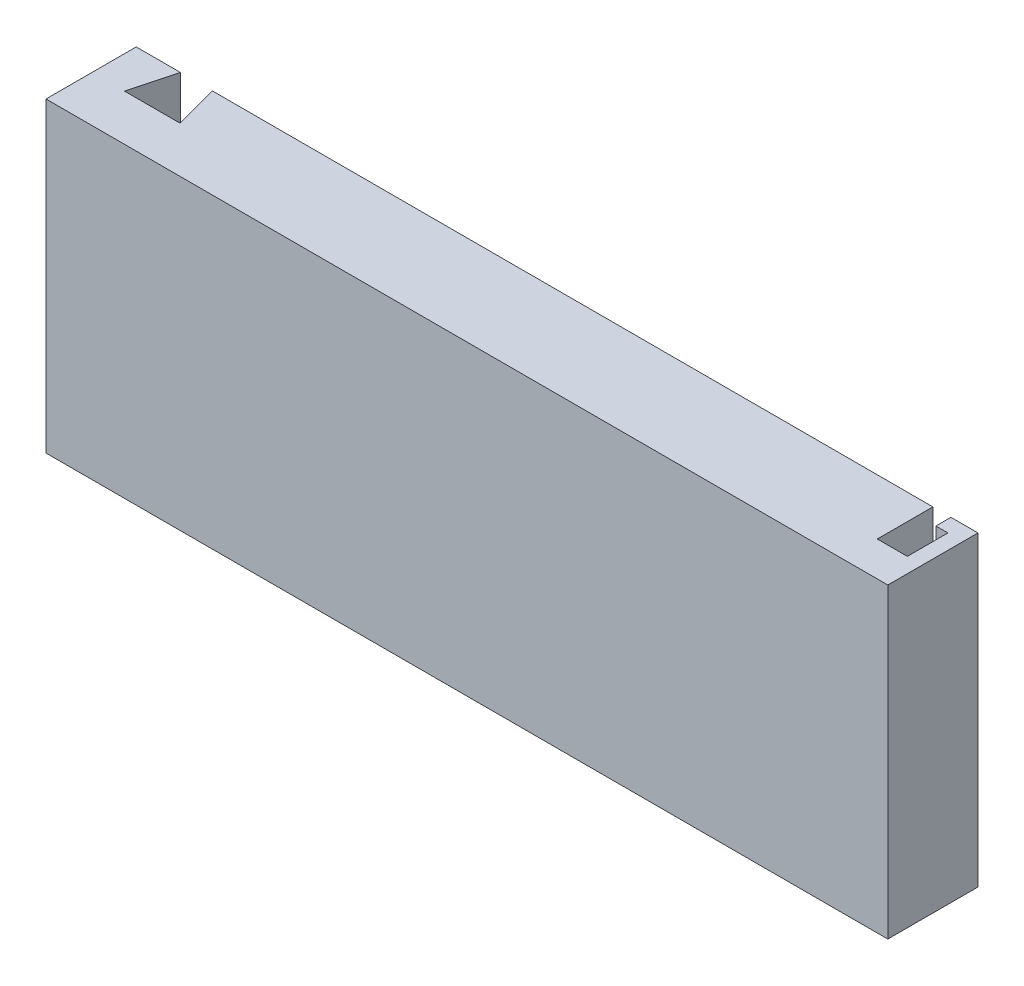
ISO-10303-21;
HEADER;
FILE_DESCRIPTION(('STEP AP214'),'2;1');
FILE_NAME('part.step','',(''),(''),'','','');
FILE_SCHEMA(('AUTOMOTIVE_DESIGN { 1 0 10303 214 1 1 1 1 }'));
ENDSEC;
DATA;
#1=APPLICATION_CONTEXT('core data for automotive mechanical design processes');
#2=APPLICATION_PROTOCOL_DEFINITION('international standard','automotive_design',2000,#1);
#3=PRODUCT_CONTEXT('',#1,'mechanical');
#4=PRODUCT('Part','Part','',(#3));
#5=PRODUCT_RELATED_PRODUCT_CATEGORY('part','',(#4));
#6=PRODUCT_DEFINITION_FORMATION('','',#4);
#7=PRODUCT_DEFINITION_CONTEXT('part definition',#1,'design');
#8=PRODUCT_DEFINITION('design','',#6,#7);
#9=PRODUCT_DEFINITION_SHAPE('','',#8);
#10=(LENGTH_UNIT() NAMED_UNIT(*) SI_UNIT(.MILLI.,.METRE.));
#11=(NAMED_UNIT(*) PLANE_ANGLE_UNIT() SI_UNIT($,.RADIAN.));
#12=(NAMED_UNIT(*) SI_UNIT($,.STERADIAN.) SOLID_ANGLE_UNIT());
#13=UNCERTAINTY_MEASURE_WITH_UNIT(LENGTH_MEASURE(1.E-05),#10,'distance_accuracy_value','');
#14=(GEOMETRIC_REPRESENTATION_CONTEXT(3) GLOBAL_UNCERTAINTY_ASSIGNED_CONTEXT((#13)) GLOBAL_UNIT_ASSIGNED_CONTEXT((#10,
#11,#12)) REPRESENTATION_CONTEXT('',''));
#15=CARTESIAN_POINT('',(0.,0.,0.));
#16=DIRECTION('',(0.,0.,1.));
#17=DIRECTION('',(1.,0.,0.));
#18=AXIS2_PLACEMENT_3D('',#15,#16,#17);
#19=CARTESIAN_POINT('',(0.,0.,0.));
#20=DIRECTION('',(0.,0.,1.));
#21=DIRECTION('',(1.,0.,0.));
#22=AXIS2_PLACEMENT_3D('',#19,#20,#21);
#23=PLANE('',#22);
#24=DIRECTION('',(0.,1.,0.));
#25=VECTOR('',#24,1.);
#26=CARTESIAN_POINT('',(74.5633802816902,-22.387323943662,0.));
#27=LINE('',#26,#25);
#28=CARTESIAN_POINT('',(74.5633802816902,-22.387323943662,0.));
#29=VERTEX_POINT('',#28);
#30=CARTESIAN_POINT('',(74.5633802816902,28.612676056338,0.));
#31=VERTEX_POINT('',#30);
#32=EDGE_CURVE('E236',#29,#31,#27,.T.);
#33=ORIENTED_EDGE('',*,*,#32,.T.);
#34=DIRECTION('',(-1.,0.,0.));
#35=VECTOR('',#34,1.);
#36=CARTESIAN_POINT('',(-60.9366197183099,28.612676056338,0.));
#37=LINE('',#36,#35);
#38=CARTESIAN_POINT('',(79.0633802816902,28.612676056338,0.));
#39=VERTEX_POINT('',#38);
#40=EDGE_CURVE('E249',#39,#31,#37,.T.);
#41=ORIENTED_EDGE('',*,*,#40,.F.);
#42=DIRECTION('',(0.,1.,0.));
#43=VECTOR('',#42,1.);
#44=CARTESIAN_POINT('',(79.0633802816902,28.612676056338,0.));
#45=LINE('',#44,#43);
#46=CARTESIAN_POINT('',(79.0633802816902,-22.387323943662,0.));
#47=VERTEX_POINT('',#46);
#48=EDGE_CURVE('E266',#47,#39,#45,.T.);
#49=ORIENTED_EDGE('',*,*,#48,.F.);
#50=DIRECTION('',(1.,0.,0.));
#51=VECTOR('',#50,1.);
#52=CARTESIAN_POINT('',(-60.9366197183099,-22.387323943662,0.));
#53=LINE('',#52,#51);
#54=EDGE_CURVE('E261',#29,#47,#53,.T.);
#55=ORIENTED_EDGE('',*,*,#54,.F.);
#56=EDGE_LOOP('',(#33,#41,#49,#55));
#57=FACE_BOUND('',#56,.T.);
#58=ADVANCED_FACE('F43',(#57),#23,.F.);
#59=CARTESIAN_POINT('',(-60.9366197183099,28.612676056338,15.));
#60=DIRECTION('',(1.,0.,0.));
#61=DIRECTION('',(0.,0.,-1.));
#62=AXIS2_PLACEMENT_3D('',#59,#60,#61);
#63=PLANE('',#62);
#64=DIRECTION('',(0.,-1.,0.));
#65=VECTOR('',#64,1.);
#66=CARTESIAN_POINT('',(-60.9366197183099,28.612676056338,0.));
#67=LINE('',#66,#65);
#68=CARTESIAN_POINT('',(-60.9366197183099,28.612676056338,0.));
#69=VERTEX_POINT('',#68);
#70=CARTESIAN_POINT('',(-60.9366197183099,-22.387323943662,0.));
#71=VERTEX_POINT('',#70);
#72=EDGE_CURVE('E229',#69,#71,#67,.T.);
#73=ORIENTED_EDGE('',*,*,#72,.T.);
#74=DIRECTION('',(0.,0.,-1.));
#75=VECTOR('',#74,1.);
#76=CARTESIAN_POINT('',(-60.9366197183099,-22.387323943662,15.));
#77=LINE('',#76,#75);
#78=CARTESIAN_POINT('',(-60.9366197183099,-22.387323943662,15.));
#79=VERTEX_POINT('',#78);
#80=EDGE_CURVE('E11',#79,#71,#77,.T.);
#81=ORIENTED_EDGE('',*,*,#80,.F.);
#82=DIRECTION('',(0.,-1.,0.));
#83=VECTOR('',#82,1.);
#84=CARTESIAN_POINT('',(-60.9366197183099,28.612676056338,15.));
#85=LINE('',#84,#83);
#86=CARTESIAN_POINT('',(-60.9366197183099,28.612676056338,15.));
#87=VERTEX_POINT('',#86);
#88=EDGE_CURVE('E244',#87,#79,#85,.T.);
#89=ORIENTED_EDGE('',*,*,#88,.F.);
#90=DIRECTION('',(0.,0.,-1.));
#91=VECTOR('',#90,1.);
#92=CARTESIAN_POINT('',(-60.9366197183099,28.612676056338,15.));
#93=LINE('',#92,#91);
#94=EDGE_CURVE('E258',#87,#69,#93,.T.);
#95=ORIENTED_EDGE('',*,*,#94,.T.);
#96=EDGE_LOOP('',(#73,#81,#89,#95));
#97=FACE_BOUND('',#96,.T.);
#98=ADVANCED_FACE('F45',(#97),#63,.F.);
#99=CARTESIAN_POINT('',(-60.9366197183099,-22.387323943662,15.));
#100=DIRECTION('',(0.,1.,0.));
#101=DIRECTION('',(0.,0.,1.));
#102=AXIS2_PLACEMENT_3D('',#99,#100,#101);
#103=PLANE('',#102);
#104=CARTESIAN_POINT('',(71.5633802816902,-22.387323943662,0.));
#105=VERTEX_POINT('',#104);
#106=EDGE_CURVE('E262',#71,#105,#53,.T.);
#107=ORIENTED_EDGE('',*,*,#106,.T.);
#108=DIRECTION('',(0.,0.,1.));
#109=VECTOR('',#108,1.);
#110=CARTESIAN_POINT('',(71.5633802816902,-22.387323943662,0.));
#111=LINE('',#110,#109);
#112=CARTESIAN_POINT('',(71.5633802816902,-22.387323943662,9.25));
#113=VERTEX_POINT('',#112);
#114=EDGE_CURVE('E201',#105,#113,#111,.T.);
#115=ORIENTED_EDGE('',*,*,#114,.T.);
#116=DIRECTION('',(1.,0.,0.));
#117=VECTOR('',#116,1.);
#118=CARTESIAN_POINT('',(0.,-22.387323943662,9.25000000000002));
#119=LINE('',#118,#117);
#120=CARTESIAN_POINT('',(76.5633802816902,-22.387323943662,9.25));
#121=VERTEX_POINT('',#120);
#122=EDGE_CURVE('E205',#113,#121,#119,.T.);
#123=ORIENTED_EDGE('',*,*,#122,.T.);
#124=DIRECTION('',(0.,0.,1.));
#125=VECTOR('',#124,1.);
#126=CARTESIAN_POINT('',(76.5633802816902,-22.387323943662,0.));
#127=LINE('',#126,#125);
#128=CARTESIAN_POINT('',(76.5633802816902,-22.387323943662,2.5));
#129=VERTEX_POINT('',#128);
#130=EDGE_CURVE('E191',#129,#121,#127,.T.);
#131=ORIENTED_EDGE('',*,*,#130,.F.);
#132=DIRECTION('',(1.,0.,0.));
#133=VECTOR('',#132,1.);
#134=CARTESIAN_POINT('',(0.,-22.387323943662,2.5));
#135=LINE('',#134,#133);
#136=CARTESIAN_POINT('',(74.5633802816902,-22.387323943662,2.5));
#137=VERTEX_POINT('',#136);
#138=EDGE_CURVE('E194',#137,#129,#135,.T.);
#139=ORIENTED_EDGE('',*,*,#138,.F.);
#140=DIRECTION('',(0.,0.,1.));
#141=VECTOR('',#140,1.);
#142=CARTESIAN_POINT('',(74.5633802816902,-22.387323943662,0.));
#143=LINE('',#142,#141);
#144=EDGE_CURVE('E198',#29,#137,#143,.T.);
#145=ORIENTED_EDGE('',*,*,#144,.F.);
#146=ORIENTED_EDGE('',*,*,#54,.T.);
#147=DIRECTION('',(0.,0.,-1.));
#148=VECTOR('',#147,1.);
#149=CARTESIAN_POINT('',(79.0633802816902,-22.387323943662,15.));
#150=LINE('',#149,#148);
#151=CARTESIAN_POINT('',(79.0633802816902,-22.387323943662,15.));
#152=VERTEX_POINT('',#151);
#153=EDGE_CURVE('E52',#152,#47,#150,.T.);
#154=ORIENTED_EDGE('',*,*,#153,.F.);
#155=DIRECTION('',(1.,0.,0.));
#156=VECTOR('',#155,1.);
#157=CARTESIAN_POINT('',(-60.9366197183099,-22.387323943662,15.));
#158=LINE('',#157,#156);
#159=EDGE_CURVE('E248',#79,#152,#158,.T.);
#160=ORIENTED_EDGE('',*,*,#159,.F.);
#161=ORIENTED_EDGE('',*,*,#80,.T.);
#162=EDGE_LOOP('',(#107,#115,#123,#131,#139,#145,#146,#154,#160,#161));
#163=FACE_BOUND('',#162,.T.);
#164=ADVANCED_FACE('F297',(#163),#103,.F.);
#165=CARTESIAN_POINT('',(79.0633802816902,28.612676056338,15.));
#166=DIRECTION('',(-1.,0.,0.));
#167=DIRECTION('',(0.,0.,1.));
#168=AXIS2_PLACEMENT_3D('',#165,#166,#167);
#169=PLANE('',#168);
#170=ORIENTED_EDGE('',*,*,#48,.T.);
#171=DIRECTION('',(0.,0.,-1.));
#172=VECTOR('',#171,1.);
#173=CARTESIAN_POINT('',(79.0633802816902,28.612676056338,15.));
#174=LINE('',#173,#172);
#175=CARTESIAN_POINT('',(79.0633802816902,28.612676056338,15.));
#176=VERTEX_POINT('',#175);
#177=EDGE_CURVE('E276',#176,#39,#174,.T.);
#178=ORIENTED_EDGE('',*,*,#177,.F.);
#179=DIRECTION('',(0.,1.,0.));
#180=VECTOR('',#179,1.);
#181=CARTESIAN_POINT('',(79.0633802816902,28.612676056338,15.));
#182=LINE('',#181,#180);
#183=EDGE_CURVE('E252',#152,#176,#182,.T.);
#184=ORIENTED_EDGE('',*,*,#183,.F.);
#185=ORIENTED_EDGE('',*,*,#153,.T.);
#186=EDGE_LOOP('',(#170,#178,#184,#185));
#187=FACE_BOUND('',#186,.T.);
#188=ADVANCED_FACE('F285',(#187),#169,.F.);
#189=CARTESIAN_POINT('',(-60.9366197183099,28.612676056338,15.));
#190=DIRECTION('',(0.,-1.,0.));
#191=DIRECTION('',(0.,0.,-1.));
#192=AXIS2_PLACEMENT_3D('',#189,#190,#191);
#193=PLANE('',#192);
#194=CARTESIAN_POINT('',(71.5633802816902,28.612676056338,0.));
#195=VERTEX_POINT('',#194);
#196=CARTESIAN_POINT('',(-48.2866197183099,28.612676056338,0.));
#197=VERTEX_POINT('',#196);
#198=EDGE_CURVE('E170',#195,#197,#37,.T.);
#199=ORIENTED_EDGE('',*,*,#198,.T.);
#200=DIRECTION('',(0.258819045102518,0.,0.965925826289069));
#201=VECTOR('',#200,1.);
#202=CARTESIAN_POINT('',(-46.3195949755307,28.612676056338,7.34103627979693));
#203=LINE('',#202,#201);
#204=CARTESIAN_POINT('',(-46.3195949755307,28.612676056338,7.34103627979693));
#205=VERTEX_POINT('',#204);
#206=EDGE_CURVE('E159',#197,#205,#203,.T.);
#207=ORIENTED_EDGE('',*,*,#206,.T.);
#208=DIRECTION('',(-1.,0.,0.));
#209=VECTOR('',#208,1.);
#210=CARTESIAN_POINT('',(-55.553644461089,28.612676056338,7.34103627979693));
#211=LINE('',#210,#209);
#212=CARTESIAN_POINT('',(-55.553644461089,28.612676056338,7.34103627979693));
#213=VERTEX_POINT('',#212);
#214=EDGE_CURVE('E147',#205,#213,#211,.T.);
#215=ORIENTED_EDGE('',*,*,#214,.T.);
#216=DIRECTION('',(0.258819045102518,0.,-0.965925826289069));
#217=VECTOR('',#216,1.);
#218=CARTESIAN_POINT('',(-53.5866197183098,28.612676056338,0.));
#219=LINE('',#218,#217);
#220=CARTESIAN_POINT('',(-53.5866197183098,28.612676056338,0.));
#221=VERTEX_POINT('',#220);
#222=EDGE_CURVE('E158',#213,#221,#219,.T.);
#223=ORIENTED_EDGE('',*,*,#222,.T.);
#224=EDGE_CURVE('E269',#221,#69,#37,.T.);
#225=ORIENTED_EDGE('',*,*,#224,.T.);
#226=ORIENTED_EDGE('',*,*,#94,.F.);
#227=DIRECTION('',(-1.,0.,0.));
#228=VECTOR('',#227,1.);
#229=CARTESIAN_POINT('',(-60.9366197183099,28.612676056338,15.));
#230=LINE('',#229,#228);
#231=EDGE_CURVE('E255',#176,#87,#230,.T.);
#232=ORIENTED_EDGE('',*,*,#231,.F.);
#233=ORIENTED_EDGE('',*,*,#177,.T.);
#234=ORIENTED_EDGE('',*,*,#40,.T.);
#235=DIRECTION('',(0.,0.,1.));
#236=VECTOR('',#235,1.);
#237=CARTESIAN_POINT('',(74.5633802816902,28.612676056338,0.));
#238=LINE('',#237,#236);
#239=CARTESIAN_POINT('',(74.5633802816902,28.612676056338,2.5));
#240=VERTEX_POINT('',#239);
#241=EDGE_CURVE('E67',#31,#240,#238,.T.);
#242=ORIENTED_EDGE('',*,*,#241,.T.);
#243=DIRECTION('',(1.,0.,0.));
#244=VECTOR('',#243,1.);
#245=CARTESIAN_POINT('',(0.,28.612676056338,2.5));
#246=LINE('',#245,#244);
#247=CARTESIAN_POINT('',(76.5633802816902,28.612676056338,2.5));
#248=VERTEX_POINT('',#247);
#249=EDGE_CURVE('E213',#240,#248,#246,.T.);
#250=ORIENTED_EDGE('',*,*,#249,.T.);
#251=DIRECTION('',(0.,0.,1.));
#252=VECTOR('',#251,1.);
#253=CARTESIAN_POINT('',(76.5633802816902,28.612676056338,0.));
#254=LINE('',#253,#252);
#255=CARTESIAN_POINT('',(76.5633802816902,28.612676056338,9.25));
#256=VERTEX_POINT('',#255);
#257=EDGE_CURVE('E164',#248,#256,#254,.T.);
#258=ORIENTED_EDGE('',*,*,#257,.T.);
#259=DIRECTION('',(1.,0.,0.));
#260=VECTOR('',#259,1.);
#261=CARTESIAN_POINT('',(0.,28.612676056338,9.25000000000002));
#262=LINE('',#261,#260);
#263=CARTESIAN_POINT('',(71.5633802816902,28.612676056338,9.25));
#264=VERTEX_POINT('',#263);
#265=EDGE_CURVE('E195',#264,#256,#262,.T.);
#266=ORIENTED_EDGE('',*,*,#265,.F.);
#267=DIRECTION('',(0.,0.,1.));
#268=VECTOR('',#267,1.);
#269=CARTESIAN_POINT('',(71.5633802816902,28.612676056338,0.));
#270=LINE('',#269,#268);
#271=EDGE_CURVE('E219',#195,#264,#270,.T.);
#272=ORIENTED_EDGE('',*,*,#271,.F.);
#273=EDGE_LOOP('',(#199,#207,#215,#223,#225,#226,#232,#233,#234,#242,#250,#258,#266,#272));
#274=FACE_BOUND('',#273,.T.);
#275=ADVANCED_FACE('F167',(#274),#193,.F.);
#276=CARTESIAN_POINT('',(0.,0.,15.));
#277=DIRECTION('',(0.,0.,1.));
#278=DIRECTION('',(1.,0.,0.));
#279=AXIS2_PLACEMENT_3D('',#276,#277,#278);
#280=PLANE('',#279);
#281=ORIENTED_EDGE('',*,*,#88,.T.);
#282=ORIENTED_EDGE('',*,*,#159,.T.);
#283=ORIENTED_EDGE('',*,*,#183,.T.);
#284=ORIENTED_EDGE('',*,*,#231,.T.);
#285=EDGE_LOOP('',(#281,#282,#283,#284));
#286=FACE_BOUND('',#285,.T.);
#287=ADVANCED_FACE('F295',(#286),#280,.T.);
#288=ORIENTED_EDGE('',*,*,#224,.F.);
#289=DIRECTION('',(0.,-1.,0.));
#290=VECTOR('',#289,1.);
#291=CARTESIAN_POINT('',(-53.5866197183098,215.80408878673,0.));
#292=LINE('',#291,#290);
#293=CARTESIAN_POINT('',(-53.5866197183098,2.61267605633802,0.));
#294=VERTEX_POINT('',#293);
#295=EDGE_CURVE('E183',#221,#294,#292,.T.);
#296=ORIENTED_EDGE('',*,*,#295,.T.);
#297=DIRECTION('',(-1.,0.,0.));
#298=VECTOR('',#297,1.);
#299=CARTESIAN_POINT('',(-60.9366197183099,2.61267605633802,0.));
#300=LINE('',#299,#298);
#301=CARTESIAN_POINT('',(-48.2866197183099,2.61267605633802,0.));
#302=VERTEX_POINT('',#301);
#303=EDGE_CURVE('E172',#302,#294,#300,.T.);
#304=ORIENTED_EDGE('',*,*,#303,.F.);
#305=DIRECTION('',(0.,-1.,0.));
#306=VECTOR('',#305,1.);
#307=CARTESIAN_POINT('',(-48.2866197183099,215.80408878673,0.));
#308=LINE('',#307,#306);
#309=EDGE_CURVE('E59',#197,#302,#308,.T.);
#310=ORIENTED_EDGE('',*,*,#309,.F.);
#311=ORIENTED_EDGE('',*,*,#198,.F.);
#312=DIRECTION('',(0.,1.,0.));
#313=VECTOR('',#312,1.);
#314=CARTESIAN_POINT('',(71.5633802816902,-22.387323943662,0.));
#315=LINE('',#314,#313);
#316=EDGE_CURVE('E233',#105,#195,#315,.T.);
#317=ORIENTED_EDGE('',*,*,#316,.F.);
#318=ORIENTED_EDGE('',*,*,#106,.F.);
#319=ORIENTED_EDGE('',*,*,#72,.F.);
#320=EDGE_LOOP('',(#288,#296,#304,#310,#311,#317,#318,#319));
#321=FACE_BOUND('',#320,.T.);
#322=ADVANCED_FACE('F304',(#321),#23,.F.);
#323=CARTESIAN_POINT('',(76.5633802816902,-22.387323943662,0.));
#324=DIRECTION('',(-1.,0.,0.));
#325=DIRECTION('',(0.,0.,1.));
#326=AXIS2_PLACEMENT_3D('',#323,#324,#325);
#327=PLANE('',#326);
#328=ORIENTED_EDGE('',*,*,#257,.F.);
#329=DIRECTION('',(0.,1.,0.));
#330=VECTOR('',#329,1.);
#331=CARTESIAN_POINT('',(76.5633802816902,-22.387323943662,2.5));
#332=LINE('',#331,#330);
#333=EDGE_CURVE('E209',#129,#248,#332,.T.);
#334=ORIENTED_EDGE('',*,*,#333,.F.);
#335=ORIENTED_EDGE('',*,*,#130,.T.);
#336=DIRECTION('',(0.,1.,0.));
#337=VECTOR('',#336,1.);
#338=CARTESIAN_POINT('',(76.5633802816902,-22.387323943662,9.25));
#339=LINE('',#338,#337);
#340=EDGE_CURVE('E226',#121,#256,#339,.T.);
#341=ORIENTED_EDGE('',*,*,#340,.T.);
#342=EDGE_LOOP('',(#328,#334,#335,#341));
#343=FACE_BOUND('',#342,.T.);
#344=ADVANCED_FACE('F318',(#343),#327,.T.);
#345=CARTESIAN_POINT('',(0.,-22.387323943662,9.25000000000002));
#346=DIRECTION('',(0.,0.,1.));
#347=DIRECTION('',(1.,0.,0.));
#348=AXIS2_PLACEMENT_3D('',#345,#346,#347);
#349=PLANE('',#348);
#350=ORIENTED_EDGE('',*,*,#265,.T.);
#351=ORIENTED_EDGE('',*,*,#340,.F.);
#352=ORIENTED_EDGE('',*,*,#122,.F.);
#353=DIRECTION('',(0.,1.,0.));
#354=VECTOR('',#353,1.);
#355=CARTESIAN_POINT('',(71.5633802816902,-22.387323943662,9.25));
#356=LINE('',#355,#354);
#357=EDGE_CURVE('E230',#113,#264,#356,.T.);
#358=ORIENTED_EDGE('',*,*,#357,.T.);
#359=EDGE_LOOP('',(#350,#351,#352,#358));
#360=FACE_BOUND('',#359,.T.);
#361=ADVANCED_FACE('F311',(#360),#349,.F.);
#362=CARTESIAN_POINT('',(71.5633802816902,-22.387323943662,0.));
#363=DIRECTION('',(-1.,0.,0.));
#364=DIRECTION('',(0.,0.,1.));
#365=AXIS2_PLACEMENT_3D('',#362,#363,#364);
#366=PLANE('',#365);
#367=ORIENTED_EDGE('',*,*,#271,.T.);
#368=ORIENTED_EDGE('',*,*,#357,.F.);
#369=ORIENTED_EDGE('',*,*,#114,.F.);
#370=ORIENTED_EDGE('',*,*,#316,.T.);
#371=EDGE_LOOP('',(#367,#368,#369,#370));
#372=FACE_BOUND('',#371,.T.);
#373=ADVANCED_FACE('F306',(#372),#366,.F.);
#374=CARTESIAN_POINT('',(74.5633802816902,-22.387323943662,0.));
#375=DIRECTION('',(-1.,0.,0.));
#376=DIRECTION('',(0.,0.,1.));
#377=AXIS2_PLACEMENT_3D('',#374,#375,#376);
#378=PLANE('',#377);
#379=ORIENTED_EDGE('',*,*,#241,.F.);
#380=ORIENTED_EDGE('',*,*,#32,.F.);
#381=ORIENTED_EDGE('',*,*,#144,.T.);
#382=DIRECTION('',(0.,1.,0.));
#383=VECTOR('',#382,1.);
#384=CARTESIAN_POINT('',(74.5633802816902,-22.387323943662,2.5));
#385=LINE('',#384,#383);
#386=EDGE_CURVE('E239',#137,#240,#385,.T.);
#387=ORIENTED_EDGE('',*,*,#386,.T.);
#388=EDGE_LOOP('',(#379,#380,#381,#387));
#389=FACE_BOUND('',#388,.T.);
#390=ADVANCED_FACE('F323',(#389),#378,.T.);
#391=CARTESIAN_POINT('',(0.,-22.387323943662,2.5));
#392=DIRECTION('',(0.,0.,1.));
#393=DIRECTION('',(1.,0.,0.));
#394=AXIS2_PLACEMENT_3D('',#391,#392,#393);
#395=PLANE('',#394);
#396=ORIENTED_EDGE('',*,*,#249,.F.);
#397=ORIENTED_EDGE('',*,*,#386,.F.);
#398=ORIENTED_EDGE('',*,*,#138,.T.);
#399=ORIENTED_EDGE('',*,*,#333,.T.);
#400=EDGE_LOOP('',(#396,#397,#398,#399));
#401=FACE_BOUND('',#400,.T.);
#402=ADVANCED_FACE('F321',(#401),#395,.T.);
#403=CARTESIAN_POINT('',(-46.3195949755307,215.80408878673,7.34103627979693));
#404=DIRECTION('',(-0.965925826289069,0.,0.258819045102518));
#405=DIRECTION('',(0.258819045102518,0.,0.965925826289069));
#406=AXIS2_PLACEMENT_3D('',#403,#404,#405);
#407=PLANE('',#406);
#408=ORIENTED_EDGE('',*,*,#206,.F.);
#409=ORIENTED_EDGE('',*,*,#309,.T.);
#410=DIRECTION('',(0.258819045102518,0.,0.965925826289069));
#411=VECTOR('',#410,1.);
#412=CARTESIAN_POINT('',(-46.3195949755307,2.61267605633803,7.34103627979693));
#413=LINE('',#412,#411);
#414=CARTESIAN_POINT('',(-46.3195949755307,2.61267605633802,7.34103627979693));
#415=VERTEX_POINT('',#414);
#416=EDGE_CURVE('E162',#302,#415,#413,.T.);
#417=ORIENTED_EDGE('',*,*,#416,.T.);
#418=DIRECTION('',(0.,-1.,0.));
#419=VECTOR('',#418,1.);
#420=CARTESIAN_POINT('',(-46.3195949755307,215.80408878673,7.34103627979693));
#421=LINE('',#420,#419);
#422=EDGE_CURVE('E151',#205,#415,#421,.T.);
#423=ORIENTED_EDGE('',*,*,#422,.F.);
#424=EDGE_LOOP('',(#408,#409,#417,#423));
#425=FACE_BOUND('',#424,.T.);
#426=ADVANCED_FACE('F161',(#425),#407,.T.);
#427=CARTESIAN_POINT('',(-55.553644461089,215.80408878673,7.34103627979693));
#428=DIRECTION('',(0.,0.,-1.));
#429=DIRECTION('',(-1.,0.,0.));
#430=AXIS2_PLACEMENT_3D('',#427,#428,#429);
#431=PLANE('',#430);
#432=ORIENTED_EDGE('',*,*,#214,.F.);
#433=ORIENTED_EDGE('',*,*,#422,.T.);
#434=DIRECTION('',(-1.,0.,0.));
#435=VECTOR('',#434,1.);
#436=CARTESIAN_POINT('',(-55.553644461089,2.61267605633803,7.34103627979693));
#437=LINE('',#436,#435);
#438=CARTESIAN_POINT('',(-55.553644461089,2.61267605633802,7.34103627979693));
#439=VERTEX_POINT('',#438);
#440=EDGE_CURVE('E177',#415,#439,#437,.T.);
#441=ORIENTED_EDGE('',*,*,#440,.T.);
#442=DIRECTION('',(0.,-1.,0.));
#443=VECTOR('',#442,1.);
#444=CARTESIAN_POINT('',(-55.553644461089,215.80408878673,7.34103627979693));
#445=LINE('',#444,#443);
#446=EDGE_CURVE('E153',#213,#439,#445,.T.);
#447=ORIENTED_EDGE('',*,*,#446,.F.);
#448=EDGE_LOOP('',(#432,#433,#441,#447));
#449=FACE_BOUND('',#448,.T.);
#450=ADVANCED_FACE('F149',(#449),#431,.T.);
#451=CARTESIAN_POINT('',(-53.5866197183098,215.80408878673,0.));
#452=DIRECTION('',(0.965925826289069,0.,0.258819045102518));
#453=DIRECTION('',(0.258819045102518,0.,-0.965925826289069));
#454=AXIS2_PLACEMENT_3D('',#451,#452,#453);
#455=PLANE('',#454);
#456=ORIENTED_EDGE('',*,*,#222,.F.);
#457=ORIENTED_EDGE('',*,*,#446,.T.);
#458=DIRECTION('',(0.258819045102518,0.,-0.965925826289069));
#459=VECTOR('',#458,1.);
#460=CARTESIAN_POINT('',(-53.5866197183098,2.61267605633803,0.));
#461=LINE('',#460,#459);
#462=EDGE_CURVE('E182',#439,#294,#461,.T.);
#463=ORIENTED_EDGE('',*,*,#462,.T.);
#464=ORIENTED_EDGE('',*,*,#295,.F.);
#465=EDGE_LOOP('',(#456,#457,#463,#464));
#466=FACE_BOUND('',#465,.T.);
#467=ADVANCED_FACE('F331',(#466),#455,.T.);
#468=CARTESIAN_POINT('',(-60.9366197183099,2.61267605633802,15.));
#469=DIRECTION('',(0.,-1.,0.));
#470=DIRECTION('',(0.,0.,-1.));
#471=AXIS2_PLACEMENT_3D('',#468,#469,#470);
#472=PLANE('',#471);
#473=ORIENTED_EDGE('',*,*,#303,.T.);
#474=ORIENTED_EDGE('',*,*,#462,.F.);
#475=ORIENTED_EDGE('',*,*,#440,.F.);
#476=ORIENTED_EDGE('',*,*,#416,.F.);
#477=EDGE_LOOP('',(#473,#474,#475,#476));
#478=FACE_BOUND('',#477,.T.);
#479=ADVANCED_FACE('F336',(#478),#472,.F.);
#480=CLOSED_SHELL('',(#58,#98,#164,#188,#275,#287,#322,#344,#361,#373,#390,#402,#426,#450,#467,#479));
#481=MANIFOLD_SOLID_BREP('B2',#480);
#482=ADVANCED_BREP_SHAPE_REPRESENTATION('',(#18,#481),#14);
#483=SHAPE_DEFINITION_REPRESENTATION(#9,#482);
ENDSEC;
END-ISO-10303-21;
